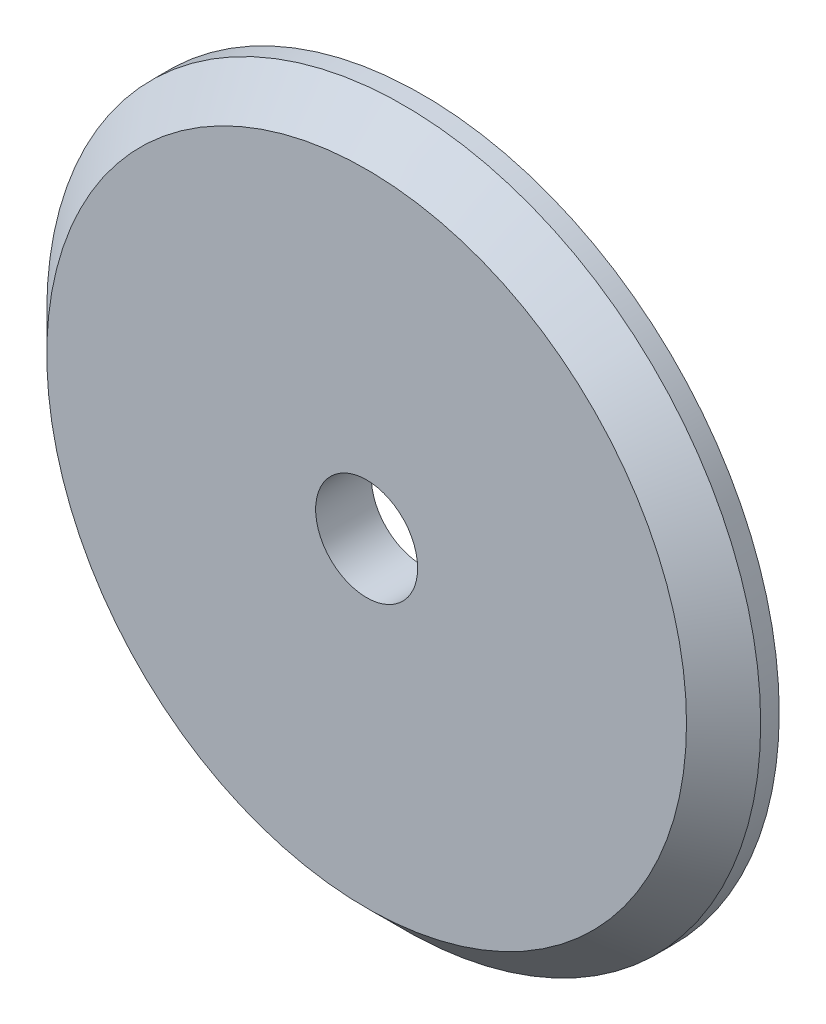
ISO-10303-21;
HEADER;
FILE_DESCRIPTION(('STEP AP214'),'2;1');
FILE_NAME('part.step','',(''),(''),'','','');
FILE_SCHEMA(('AUTOMOTIVE_DESIGN { 1 0 10303 214 1 1 1 1 }'));
ENDSEC;
DATA;
#1=APPLICATION_CONTEXT('core data for automotive mechanical design processes');
#2=APPLICATION_PROTOCOL_DEFINITION('international standard','automotive_design',2000,#1);
#3=PRODUCT_CONTEXT('',#1,'mechanical');
#4=PRODUCT('Part','Part','',(#3));
#5=PRODUCT_RELATED_PRODUCT_CATEGORY('part','',(#4));
#6=PRODUCT_DEFINITION_FORMATION('','',#4);
#7=PRODUCT_DEFINITION_CONTEXT('part definition',#1,'design');
#8=PRODUCT_DEFINITION('design','',#6,#7);
#9=PRODUCT_DEFINITION_SHAPE('','',#8);
#10=(LENGTH_UNIT() NAMED_UNIT(*) SI_UNIT(.MILLI.,.METRE.));
#11=(NAMED_UNIT(*) PLANE_ANGLE_UNIT() SI_UNIT($,.RADIAN.));
#12=(NAMED_UNIT(*) SI_UNIT($,.STERADIAN.) SOLID_ANGLE_UNIT());
#13=UNCERTAINTY_MEASURE_WITH_UNIT(LENGTH_MEASURE(1.E-05),#10,'distance_accuracy_value','');
#14=(GEOMETRIC_REPRESENTATION_CONTEXT(3) GLOBAL_UNCERTAINTY_ASSIGNED_CONTEXT((#13)) GLOBAL_UNIT_ASSIGNED_CONTEXT((#10,
#11,#12)) REPRESENTATION_CONTEXT('',''));
#15=CARTESIAN_POINT('',(0.,0.,0.));
#16=DIRECTION('',(0.,0.,1.));
#17=DIRECTION('',(1.,0.,0.));
#18=AXIS2_PLACEMENT_3D('',#15,#16,#17);
#19=CARTESIAN_POINT('',(0.,0.,0.));
#20=DIRECTION('',(0.,0.,1.));
#21=DIRECTION('',(1.,0.,0.));
#22=AXIS2_PLACEMENT_3D('',#19,#20,#21);
#23=PLANE('',#22);
#24=CARTESIAN_POINT('',(0.,0.,0.));
#25=DIRECTION('',(0.,0.,-1.));
#26=DIRECTION('',(-1.,0.,0.));
#27=AXIS2_PLACEMENT_3D('',#24,#25,#26);
#28=CIRCLE('',#27,3.4925);
#29=CARTESIAN_POINT('',(3.4925,0.,0.));
#30=VERTEX_POINT('',#29);
#31=EDGE_CURVE('E11',#30,#30,#28,.T.);
#32=ORIENTED_EDGE('',*,*,#31,.F.);
#33=EDGE_LOOP('',(#32));
#34=FACE_BOUND('',#33,.T.);
#35=CARTESIAN_POINT('',(0.,0.,0.));
#36=DIRECTION('',(0.,0.,1.));
#37=DIRECTION('',(1.,0.,0.));
#38=AXIS2_PLACEMENT_3D('',#35,#36,#37);
#39=CIRCLE('',#38,24.4475);
#40=CARTESIAN_POINT('',(-24.4475,0.,0.));
#41=VERTEX_POINT('',#40);
#42=EDGE_CURVE('E84',#41,#41,#39,.T.);
#43=ORIENTED_EDGE('',*,*,#42,.F.);
#44=EDGE_LOOP('',(#43));
#45=FACE_BOUND('',#44,.T.);
#46=ADVANCED_FACE('F17',(#34,#45),#23,.F.);
#47=CARTESIAN_POINT('',(0.,0.,0.));
#48=DIRECTION('',(0.,0.,1.));
#49=DIRECTION('',(-1.,0.,0.));
#50=AXIS2_PLACEMENT_3D('',#47,#48,#49);
#51=CYLINDRICAL_SURFACE('',#50,3.4925);
#52=CARTESIAN_POINT('',(0.,0.,3.81));
#53=DIRECTION('',(0.,0.,-1.));
#54=DIRECTION('',(-1.,0.,0.));
#55=AXIS2_PLACEMENT_3D('',#52,#53,#54);
#56=CIRCLE('',#55,3.4925);
#57=CARTESIAN_POINT('',(3.4925,0.,3.81));
#58=VERTEX_POINT('',#57);
#59=EDGE_CURVE('E88',#58,#58,#56,.T.);
#60=ORIENTED_EDGE('',*,*,#59,.F.);
#61=DIRECTION('',(0.,0.,-1.));
#62=VECTOR('',#61,1.);
#63=CARTESIAN_POINT('',(3.4925,0.,0.));
#64=LINE('',#63,#62);
#65=EDGE_CURVE('E25',#58,#30,#64,.T.);
#66=ORIENTED_EDGE('',*,*,#65,.T.);
#67=ORIENTED_EDGE('',*,*,#31,.T.);
#68=ORIENTED_EDGE('',*,*,#65,.F.);
#69=EDGE_LOOP('',(#60,#66,#67,#68));
#70=FACE_BOUND('',#69,.T.);
#71=ADVANCED_FACE('F96',(#70),#51,.F.);
#72=CARTESIAN_POINT('',(0.,0.,3.81));
#73=DIRECTION('',(0.,0.,1.));
#74=DIRECTION('',(1.,0.,0.));
#75=AXIS2_PLACEMENT_3D('',#72,#73,#74);
#76=PLANE('',#75);
#77=ORIENTED_EDGE('',*,*,#59,.T.);
#78=EDGE_LOOP('',(#77));
#79=FACE_BOUND('',#78,.T.);
#80=CARTESIAN_POINT('',(0.,0.,3.81));
#81=DIRECTION('',(0.,0.,-1.));
#82=DIRECTION('',(-1.,0.,0.));
#83=AXIS2_PLACEMENT_3D('',#80,#81,#82);
#84=CIRCLE('',#83,21.9075);
#85=CARTESIAN_POINT('',(21.9075,0.,3.81));
#86=VERTEX_POINT('',#85);
#87=EDGE_CURVE('E63',#86,#86,#84,.T.);
#88=ORIENTED_EDGE('',*,*,#87,.F.);
#89=EDGE_LOOP('',(#88));
#90=FACE_BOUND('',#89,.T.);
#91=ADVANCED_FACE('F98',(#79,#90),#76,.T.);
#92=CARTESIAN_POINT('',(0.,0.,0.));
#93=DIRECTION('',(0.,0.,1.));
#94=DIRECTION('',(1.,0.,0.));
#95=AXIS2_PLACEMENT_3D('',#92,#93,#94);
#96=CYLINDRICAL_SURFACE('',#95,24.4475);
#97=CARTESIAN_POINT('',(0.,0.,1.27));
#98=DIRECTION('',(0.,0.,1.));
#99=DIRECTION('',(-1.,0.,0.));
#100=AXIS2_PLACEMENT_3D('',#97,#98,#99);
#101=CIRCLE('',#100,24.4475);
#102=CARTESIAN_POINT('',(24.4475,0.,1.27));
#103=VERTEX_POINT('',#102);
#104=CARTESIAN_POINT('',(-24.4475,0.,1.27));
#105=VERTEX_POINT('',#104);
#106=EDGE_CURVE('E69',#103,#105,#101,.T.);
#107=ORIENTED_EDGE('',*,*,#106,.F.);
#108=CARTESIAN_POINT('',(0.,0.,1.27));
#109=DIRECTION('',(0.,0.,1.));
#110=DIRECTION('',(-1.,0.,0.));
#111=AXIS2_PLACEMENT_3D('',#108,#109,#110);
#112=CIRCLE('',#111,24.4475);
#113=EDGE_CURVE('E66',#105,#103,#112,.T.);
#114=ORIENTED_EDGE('',*,*,#113,.F.);
#115=DIRECTION('',(0.,0.,-1.));
#116=VECTOR('',#115,1.);
#117=CARTESIAN_POINT('',(-24.4475,0.,0.));
#118=LINE('',#117,#116);
#119=EDGE_CURVE('E80',#105,#41,#118,.T.);
#120=ORIENTED_EDGE('',*,*,#119,.T.);
#121=ORIENTED_EDGE('',*,*,#42,.T.);
#122=ORIENTED_EDGE('',*,*,#119,.F.);
#123=EDGE_LOOP('',(#107,#114,#120,#121,#122));
#124=FACE_BOUND('',#123,.T.);
#125=ADVANCED_FACE('F105',(#124),#96,.T.);
#126=CARTESIAN_POINT('',(0.,0.,2.54));
#127=DIRECTION('',(0.,0.,-1.));
#128=DIRECTION('',(-1.,0.,0.));
#129=AXIS2_PLACEMENT_3D('',#126,#127,#128);
#130=CONICAL_SURFACE('',#129,23.1775,0.785398163397448);
#131=ORIENTED_EDGE('',*,*,#87,.T.);
#132=DIRECTION('',(0.707106781186548,0.,-0.707106781186548));
#133=VECTOR('',#132,1.);
#134=CARTESIAN_POINT('',(23.1775,0.,2.54));
#135=LINE('',#134,#133);
#136=EDGE_CURVE('E60',#86,#103,#135,.T.);
#137=ORIENTED_EDGE('',*,*,#136,.T.);
#138=ORIENTED_EDGE('',*,*,#106,.T.);
#139=ORIENTED_EDGE('',*,*,#113,.T.);
#140=ORIENTED_EDGE('',*,*,#136,.F.);
#141=EDGE_LOOP('',(#131,#137,#138,#139,#140));
#142=FACE_BOUND('',#141,.T.);
#143=ADVANCED_FACE('F61',(#142),#130,.T.);
#144=CLOSED_SHELL('',(#46,#71,#91,#125,#143));
#145=MANIFOLD_SOLID_BREP('B1',#144);
#146=ADVANCED_BREP_SHAPE_REPRESENTATION('',(#18,#145),#14);
#147=SHAPE_DEFINITION_REPRESENTATION(#9,#146);
ENDSEC;
END-ISO-10303-21;
